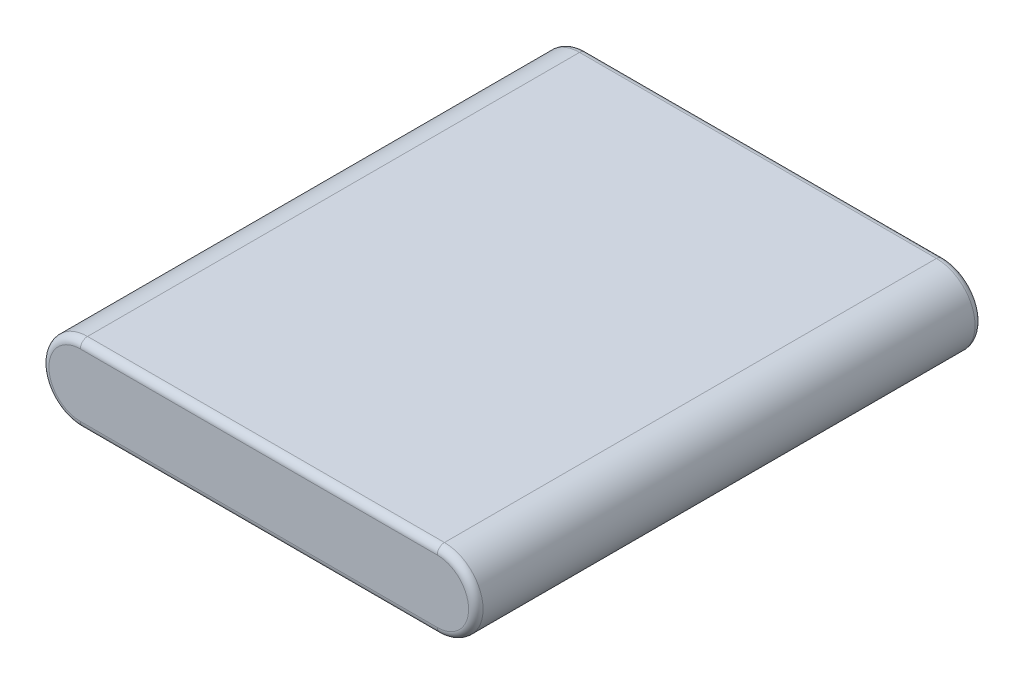
ISO-10303-21;
HEADER;
FILE_DESCRIPTION(('STEP AP214'),'2;1');
FILE_NAME('part.step','',(''),(''),'','','');
FILE_SCHEMA(('AUTOMOTIVE_DESIGN { 1 0 10303 214 1 1 1 1 }'));
ENDSEC;
DATA;
#1=APPLICATION_CONTEXT('core data for automotive mechanical design processes');
#2=APPLICATION_PROTOCOL_DEFINITION('international standard','automotive_design',2000,#1);
#3=PRODUCT_CONTEXT('',#1,'mechanical');
#4=PRODUCT('Part','Part','',(#3));
#5=PRODUCT_RELATED_PRODUCT_CATEGORY('part','',(#4));
#6=PRODUCT_DEFINITION_FORMATION('','',#4);
#7=PRODUCT_DEFINITION_CONTEXT('part definition',#1,'design');
#8=PRODUCT_DEFINITION('design','',#6,#7);
#9=PRODUCT_DEFINITION_SHAPE('','',#8);
#10=(LENGTH_UNIT() NAMED_UNIT(*) SI_UNIT(.MILLI.,.METRE.));
#11=(NAMED_UNIT(*) PLANE_ANGLE_UNIT() SI_UNIT($,.RADIAN.));
#12=(NAMED_UNIT(*) SI_UNIT($,.STERADIAN.) SOLID_ANGLE_UNIT());
#13=UNCERTAINTY_MEASURE_WITH_UNIT(LENGTH_MEASURE(1.E-05),#10,'distance_accuracy_value','');
#14=(GEOMETRIC_REPRESENTATION_CONTEXT(3) GLOBAL_UNCERTAINTY_ASSIGNED_CONTEXT((#13)) GLOBAL_UNIT_ASSIGNED_CONTEXT((#10,
#11,#12)) REPRESENTATION_CONTEXT('',''));
#15=CARTESIAN_POINT('',(0.,0.,0.));
#16=DIRECTION('',(0.,0.,1.));
#17=DIRECTION('',(1.,0.,0.));
#18=AXIS2_PLACEMENT_3D('',#15,#16,#17);
#19=CARTESIAN_POINT('',(37.,0.,52.5));
#20=DIRECTION('',(0.,0.,-1.));
#21=DIRECTION('',(-1.,0.,0.));
#22=AXIS2_PLACEMENT_3D('',#19,#20,#21);
#23=CYLINDRICAL_SURFACE('',#22,7.99999999999999);
#24=DIRECTION('',(0.,0.,-1.));
#25=VECTOR('',#24,1.);
#26=CARTESIAN_POINT('',(37.,-7.99999999999998,52.5));
#27=LINE('',#26,#25);
#28=CARTESIAN_POINT('',(37.,-7.99999999999998,51.));
#29=VERTEX_POINT('',#28);
#30=CARTESIAN_POINT('',(37.,-7.99999999999998,-51.));
#31=VERTEX_POINT('',#30);
#32=EDGE_CURVE('E141',#29,#31,#27,.T.);
#33=ORIENTED_EDGE('',*,*,#32,.T.);
#34=CARTESIAN_POINT('',(37.,0.,-51.));
#35=DIRECTION('',(0.,0.,1.));
#36=DIRECTION('',(1.,0.,0.));
#37=AXIS2_PLACEMENT_3D('',#34,#35,#36);
#38=CIRCLE('',#37,7.99999999999999);
#39=CARTESIAN_POINT('',(37.,8.00000000000001,-51.));
#40=VERTEX_POINT('',#39);
#41=EDGE_CURVE('E150',#31,#40,#38,.T.);
#42=ORIENTED_EDGE('',*,*,#41,.T.);
#43=DIRECTION('',(0.,0.,-1.));
#44=VECTOR('',#43,1.);
#45=CARTESIAN_POINT('',(37.,8.00000000000001,52.5));
#46=LINE('',#45,#44);
#47=CARTESIAN_POINT('',(37.,8.00000000000001,51.));
#48=VERTEX_POINT('',#47);
#49=EDGE_CURVE('E119',#48,#40,#46,.T.);
#50=ORIENTED_EDGE('',*,*,#49,.F.);
#51=CARTESIAN_POINT('',(37.,0.,51.));
#52=DIRECTION('',(0.,0.,1.));
#53=DIRECTION('',(1.,0.,0.));
#54=AXIS2_PLACEMENT_3D('',#51,#52,#53);
#55=CIRCLE('',#54,7.99999999999999);
#56=EDGE_CURVE('E152',#48,#29,#55,.F.);
#57=ORIENTED_EDGE('',*,*,#56,.T.);
#58=EDGE_LOOP('',(#33,#42,#50,#57));
#59=FACE_BOUND('',#58,.T.);
#60=ADVANCED_FACE('F32',(#59),#23,.T.);
#61=CARTESIAN_POINT('',(37.,8.00000000000001,52.5));
#62=DIRECTION('',(0.,-1.,0.));
#63=DIRECTION('',(1.,0.,0.));
#64=AXIS2_PLACEMENT_3D('',#61,#62,#63);
#65=PLANE('',#64);
#66=ORIENTED_EDGE('',*,*,#49,.T.);
#67=DIRECTION('',(-1.,0.,0.));
#68=VECTOR('',#67,1.);
#69=CARTESIAN_POINT('',(37.,8.00000000000001,-51.));
#70=LINE('',#69,#68);
#71=CARTESIAN_POINT('',(-37.,8.00000000000001,-51.));
#72=VERTEX_POINT('',#71);
#73=EDGE_CURVE('E118',#40,#72,#70,.T.);
#74=ORIENTED_EDGE('',*,*,#73,.T.);
#75=DIRECTION('',(0.,0.,-1.));
#76=VECTOR('',#75,1.);
#77=CARTESIAN_POINT('',(-37.,8.00000000000001,52.5));
#78=LINE('',#77,#76);
#79=CARTESIAN_POINT('',(-37.,8.00000000000001,51.));
#80=VERTEX_POINT('',#79);
#81=EDGE_CURVE('E101',#80,#72,#78,.T.);
#82=ORIENTED_EDGE('',*,*,#81,.F.);
#83=DIRECTION('',(-1.,0.,0.));
#84=VECTOR('',#83,1.);
#85=CARTESIAN_POINT('',(37.,8.00000000000001,51.));
#86=LINE('',#85,#84);
#87=EDGE_CURVE('E115',#80,#48,#86,.F.);
#88=ORIENTED_EDGE('',*,*,#87,.T.);
#89=EDGE_LOOP('',(#66,#74,#82,#88));
#90=FACE_BOUND('',#89,.T.);
#91=ADVANCED_FACE('F114',(#90),#65,.F.);
#92=CARTESIAN_POINT('',(-37.,0.,52.5));
#93=DIRECTION('',(0.,0.,-1.));
#94=DIRECTION('',(-1.,0.,0.));
#95=AXIS2_PLACEMENT_3D('',#92,#93,#94);
#96=CYLINDRICAL_SURFACE('',#95,8.);
#97=ORIENTED_EDGE('',*,*,#81,.T.);
#98=CARTESIAN_POINT('',(-37.,0.,-51.));
#99=DIRECTION('',(0.,0.,1.));
#100=DIRECTION('',(1.,0.,0.));
#101=AXIS2_PLACEMENT_3D('',#98,#99,#100);
#102=CIRCLE('',#101,8.);
#103=CARTESIAN_POINT('',(-37.,-7.99999999999999,-51.));
#104=VERTEX_POINT('',#103);
#105=EDGE_CURVE('E107',#72,#104,#102,.T.);
#106=ORIENTED_EDGE('',*,*,#105,.T.);
#107=DIRECTION('',(0.,0.,-1.));
#108=VECTOR('',#107,1.);
#109=CARTESIAN_POINT('',(-37.,-7.99999999999999,52.5));
#110=LINE('',#109,#108);
#111=CARTESIAN_POINT('',(-37.,-7.99999999999999,51.));
#112=VERTEX_POINT('',#111);
#113=EDGE_CURVE('E103',#112,#104,#110,.T.);
#114=ORIENTED_EDGE('',*,*,#113,.F.);
#115=CARTESIAN_POINT('',(-37.,0.,51.));
#116=DIRECTION('',(0.,0.,1.));
#117=DIRECTION('',(1.,0.,0.));
#118=AXIS2_PLACEMENT_3D('',#115,#116,#117);
#119=CIRCLE('',#118,8.);
#120=EDGE_CURVE('E98',#112,#80,#119,.F.);
#121=ORIENTED_EDGE('',*,*,#120,.T.);
#122=EDGE_LOOP('',(#97,#106,#114,#121));
#123=FACE_BOUND('',#122,.T.);
#124=ADVANCED_FACE('F100',(#123),#96,.T.);
#125=CARTESIAN_POINT('',(37.,-7.99999999999998,52.5));
#126=DIRECTION('',(0.,1.,0.));
#127=DIRECTION('',(-1.,0.,0.));
#128=AXIS2_PLACEMENT_3D('',#125,#126,#127);
#129=PLANE('',#128);
#130=ORIENTED_EDGE('',*,*,#113,.T.);
#131=DIRECTION('',(1.,0.,0.));
#132=VECTOR('',#131,1.);
#133=CARTESIAN_POINT('',(37.,-7.99999999999998,-51.));
#134=LINE('',#133,#132);
#135=EDGE_CURVE('E154',#104,#31,#134,.T.);
#136=ORIENTED_EDGE('',*,*,#135,.T.);
#137=ORIENTED_EDGE('',*,*,#32,.F.);
#138=DIRECTION('',(1.,0.,0.));
#139=VECTOR('',#138,1.);
#140=CARTESIAN_POINT('',(-37.,-7.99999999999999,51.));
#141=LINE('',#140,#139);
#142=EDGE_CURVE('E156',#29,#112,#141,.F.);
#143=ORIENTED_EDGE('',*,*,#142,.T.);
#144=EDGE_LOOP('',(#130,#136,#137,#143));
#145=FACE_BOUND('',#144,.T.);
#146=ADVANCED_FACE('F194',(#145),#129,.F.);
#147=CARTESIAN_POINT('',(37.,0.,52.5));
#148=DIRECTION('',(0.,0.,1.));
#149=DIRECTION('',(1.,0.,0.));
#150=AXIS2_PLACEMENT_3D('',#147,#148,#149);
#151=PLANE('',#150);
#152=CARTESIAN_POINT('',(-37.,0.,52.5));
#153=DIRECTION('',(0.,0.,1.));
#154=DIRECTION('',(1.,0.,0.));
#155=AXIS2_PLACEMENT_3D('',#152,#153,#154);
#156=CIRCLE('',#155,6.5);
#157=CARTESIAN_POINT('',(-37.,6.50000000000001,52.5));
#158=VERTEX_POINT('',#157);
#159=CARTESIAN_POINT('',(-37.,-6.49999999999999,52.5));
#160=VERTEX_POINT('',#159);
#161=EDGE_CURVE('E41',#158,#160,#156,.T.);
#162=ORIENTED_EDGE('',*,*,#161,.T.);
#163=DIRECTION('',(1.,0.,0.));
#164=VECTOR('',#163,1.);
#165=CARTESIAN_POINT('',(37.,-6.49999999999998,52.5));
#166=LINE('',#165,#164);
#167=CARTESIAN_POINT('',(37.,-6.49999999999998,52.5));
#168=VERTEX_POINT('',#167);
#169=EDGE_CURVE('E11',#160,#168,#166,.T.);
#170=ORIENTED_EDGE('',*,*,#169,.T.);
#171=CARTESIAN_POINT('',(37.,0.,52.5));
#172=DIRECTION('',(0.,0.,1.));
#173=DIRECTION('',(1.,0.,0.));
#174=AXIS2_PLACEMENT_3D('',#171,#172,#173);
#175=CIRCLE('',#174,6.5);
#176=CARTESIAN_POINT('',(37.,6.50000000000001,52.5));
#177=VERTEX_POINT('',#176);
#178=EDGE_CURVE('E148',#168,#177,#175,.T.);
#179=ORIENTED_EDGE('',*,*,#178,.T.);
#180=DIRECTION('',(-1.,0.,0.));
#181=VECTOR('',#180,1.);
#182=CARTESIAN_POINT('',(-37.,6.50000000000001,52.5));
#183=LINE('',#182,#181);
#184=EDGE_CURVE('E52',#177,#158,#183,.T.);
#185=ORIENTED_EDGE('',*,*,#184,.T.);
#186=EDGE_LOOP('',(#162,#170,#179,#185));
#187=FACE_BOUND('',#186,.T.);
#188=ADVANCED_FACE('F200',(#187),#151,.T.);
#189=CARTESIAN_POINT('',(37.,0.,-52.5));
#190=DIRECTION('',(0.,0.,1.));
#191=DIRECTION('',(1.,0.,0.));
#192=AXIS2_PLACEMENT_3D('',#189,#190,#191);
#193=PLANE('',#192);
#194=CARTESIAN_POINT('',(-37.,0.,-52.5));
#195=DIRECTION('',(0.,0.,1.));
#196=DIRECTION('',(1.,0.,0.));
#197=AXIS2_PLACEMENT_3D('',#194,#195,#196);
#198=CIRCLE('',#197,6.5);
#199=CARTESIAN_POINT('',(-37.,-6.49999999999999,-52.5));
#200=VERTEX_POINT('',#199);
#201=CARTESIAN_POINT('',(-37.,6.50000000000001,-52.5));
#202=VERTEX_POINT('',#201);
#203=EDGE_CURVE('E161',#200,#202,#198,.F.);
#204=ORIENTED_EDGE('',*,*,#203,.T.);
#205=DIRECTION('',(-1.,0.,0.));
#206=VECTOR('',#205,1.);
#207=CARTESIAN_POINT('',(37.,6.50000000000001,-52.5));
#208=LINE('',#207,#206);
#209=CARTESIAN_POINT('',(37.,6.50000000000001,-52.5));
#210=VERTEX_POINT('',#209);
#211=EDGE_CURVE('E108',#202,#210,#208,.F.);
#212=ORIENTED_EDGE('',*,*,#211,.T.);
#213=CARTESIAN_POINT('',(37.,0.,-52.5));
#214=DIRECTION('',(0.,0.,1.));
#215=DIRECTION('',(1.,0.,0.));
#216=AXIS2_PLACEMENT_3D('',#213,#214,#215);
#217=CIRCLE('',#216,6.5);
#218=CARTESIAN_POINT('',(37.,-6.49999999999998,-52.5));
#219=VERTEX_POINT('',#218);
#220=EDGE_CURVE('E165',#210,#219,#217,.F.);
#221=ORIENTED_EDGE('',*,*,#220,.T.);
#222=DIRECTION('',(1.,0.,0.));
#223=VECTOR('',#222,1.);
#224=CARTESIAN_POINT('',(37.,-6.49999999999998,-52.5));
#225=LINE('',#224,#223);
#226=EDGE_CURVE('E163',#219,#200,#225,.F.);
#227=ORIENTED_EDGE('',*,*,#226,.T.);
#228=EDGE_LOOP('',(#204,#212,#221,#227));
#229=FACE_BOUND('',#228,.T.);
#230=ADVANCED_FACE('F202',(#229),#193,.F.);
#231=CARTESIAN_POINT('',(37.,-6.49999999999998,-51.));
#232=DIRECTION('',(1.,0.,0.));
#233=DIRECTION('',(0.,1.,0.));
#234=AXIS2_PLACEMENT_3D('',#231,#232,#233);
#235=CYLINDRICAL_SURFACE('',#234,1.5);
#236=CARTESIAN_POINT('',(-37.,-6.49999999999999,-51.));
#237=DIRECTION('',(-1.,0.,0.));
#238=DIRECTION('',(0.,0.,1.));
#239=AXIS2_PLACEMENT_3D('',#236,#237,#238);
#240=CIRCLE('',#239,1.5);
#241=EDGE_CURVE('E142',#200,#104,#240,.T.);
#242=ORIENTED_EDGE('',*,*,#241,.F.);
#243=ORIENTED_EDGE('',*,*,#226,.F.);
#244=CARTESIAN_POINT('',(37.,-6.49999999999998,-51.));
#245=DIRECTION('',(1.,0.,0.));
#246=DIRECTION('',(0.,0.,-1.));
#247=AXIS2_PLACEMENT_3D('',#244,#245,#246);
#248=CIRCLE('',#247,1.5);
#249=EDGE_CURVE('E138',#31,#219,#248,.T.);
#250=ORIENTED_EDGE('',*,*,#249,.F.);
#251=ORIENTED_EDGE('',*,*,#135,.F.);
#252=EDGE_LOOP('',(#242,#243,#250,#251));
#253=FACE_BOUND('',#252,.T.);
#254=ADVANCED_FACE('F181',(#253),#235,.T.);
#255=CARTESIAN_POINT('',(37.,0.,-51.));
#256=DIRECTION('',(0.,0.,1.));
#257=DIRECTION('',(1.,0.,0.));
#258=AXIS2_PLACEMENT_3D('',#255,#256,#257);
#259=TOROIDAL_SURFACE('',#258,6.5,1.5);
#260=ORIENTED_EDGE('',*,*,#249,.T.);
#261=ORIENTED_EDGE('',*,*,#220,.F.);
#262=CARTESIAN_POINT('',(37.,6.50000000000001,-51.));
#263=DIRECTION('',(-1.,0.,0.));
#264=DIRECTION('',(0.,0.,1.));
#265=AXIS2_PLACEMENT_3D('',#262,#263,#264);
#266=CIRCLE('',#265,1.5);
#267=EDGE_CURVE('E129',#40,#210,#266,.T.);
#268=ORIENTED_EDGE('',*,*,#267,.F.);
#269=ORIENTED_EDGE('',*,*,#41,.F.);
#270=EDGE_LOOP('',(#260,#261,#268,#269));
#271=FACE_BOUND('',#270,.T.);
#272=ADVANCED_FACE('F185',(#271),#259,.T.);
#273=CARTESIAN_POINT('',(-37.,0.,-51.));
#274=DIRECTION('',(0.,0.,1.));
#275=DIRECTION('',(1.,0.,0.));
#276=AXIS2_PLACEMENT_3D('',#273,#274,#275);
#277=TOROIDAL_SURFACE('',#276,6.5,1.5);
#278=ORIENTED_EDGE('',*,*,#241,.T.);
#279=ORIENTED_EDGE('',*,*,#105,.F.);
#280=CARTESIAN_POINT('',(-37.,6.50000000000001,-51.));
#281=DIRECTION('',(1.,0.,0.));
#282=DIRECTION('',(0.,0.,-1.));
#283=AXIS2_PLACEMENT_3D('',#280,#281,#282);
#284=CIRCLE('',#283,1.5);
#285=EDGE_CURVE('E128',#202,#72,#284,.T.);
#286=ORIENTED_EDGE('',*,*,#285,.F.);
#287=ORIENTED_EDGE('',*,*,#203,.F.);
#288=EDGE_LOOP('',(#278,#279,#286,#287));
#289=FACE_BOUND('',#288,.T.);
#290=ADVANCED_FACE('F193',(#289),#277,.T.);
#291=CARTESIAN_POINT('',(37.,6.50000000000001,-51.));
#292=DIRECTION('',(-1.,0.,0.));
#293=DIRECTION('',(0.,-1.,0.));
#294=AXIS2_PLACEMENT_3D('',#291,#292,#293);
#295=CYLINDRICAL_SURFACE('',#294,1.5);
#296=ORIENTED_EDGE('',*,*,#267,.T.);
#297=ORIENTED_EDGE('',*,*,#211,.F.);
#298=ORIENTED_EDGE('',*,*,#285,.T.);
#299=ORIENTED_EDGE('',*,*,#73,.F.);
#300=EDGE_LOOP('',(#296,#297,#298,#299));
#301=FACE_BOUND('',#300,.T.);
#302=ADVANCED_FACE('F188',(#301),#295,.T.);
#303=CARTESIAN_POINT('',(37.,6.50000000000001,51.));
#304=DIRECTION('',(1.,0.,0.));
#305=DIRECTION('',(0.,1.,0.));
#306=AXIS2_PLACEMENT_3D('',#303,#304,#305);
#307=CYLINDRICAL_SURFACE('',#306,1.5);
#308=CARTESIAN_POINT('',(37.,6.50000000000001,51.));
#309=DIRECTION('',(1.,0.,0.));
#310=DIRECTION('',(0.,0.,-1.));
#311=AXIS2_PLACEMENT_3D('',#308,#309,#310);
#312=CIRCLE('',#311,1.5);
#313=EDGE_CURVE('E124',#48,#177,#312,.T.);
#314=ORIENTED_EDGE('',*,*,#313,.F.);
#315=ORIENTED_EDGE('',*,*,#87,.F.);
#316=CARTESIAN_POINT('',(-37.,6.50000000000001,51.));
#317=DIRECTION('',(-1.,0.,0.));
#318=DIRECTION('',(0.,0.,1.));
#319=AXIS2_PLACEMENT_3D('',#316,#317,#318);
#320=CIRCLE('',#319,1.5);
#321=EDGE_CURVE('E36',#158,#80,#320,.T.);
#322=ORIENTED_EDGE('',*,*,#321,.F.);
#323=ORIENTED_EDGE('',*,*,#184,.F.);
#324=EDGE_LOOP('',(#314,#315,#322,#323));
#325=FACE_BOUND('',#324,.T.);
#326=ADVANCED_FACE('F34',(#325),#307,.T.);
#327=CARTESIAN_POINT('',(-37.,0.,51.));
#328=DIRECTION('',(0.,0.,1.));
#329=DIRECTION('',(1.,0.,0.));
#330=AXIS2_PLACEMENT_3D('',#327,#328,#329);
#331=TOROIDAL_SURFACE('',#330,6.5,1.5);
#332=ORIENTED_EDGE('',*,*,#321,.T.);
#333=ORIENTED_EDGE('',*,*,#120,.F.);
#334=CARTESIAN_POINT('',(-37.,-6.49999999999999,51.));
#335=DIRECTION('',(1.,0.,0.));
#336=DIRECTION('',(0.,0.,-1.));
#337=AXIS2_PLACEMENT_3D('',#334,#335,#336);
#338=CIRCLE('',#337,1.5);
#339=EDGE_CURVE('E131',#160,#112,#338,.T.);
#340=ORIENTED_EDGE('',*,*,#339,.F.);
#341=ORIENTED_EDGE('',*,*,#161,.F.);
#342=EDGE_LOOP('',(#332,#333,#340,#341));
#343=FACE_BOUND('',#342,.T.);
#344=ADVANCED_FACE('F127',(#343),#331,.T.);
#345=CARTESIAN_POINT('',(37.,0.,51.));
#346=DIRECTION('',(0.,0.,1.));
#347=DIRECTION('',(1.,0.,0.));
#348=AXIS2_PLACEMENT_3D('',#345,#346,#347);
#349=TOROIDAL_SURFACE('',#348,6.5,1.5);
#350=ORIENTED_EDGE('',*,*,#313,.T.);
#351=ORIENTED_EDGE('',*,*,#178,.F.);
#352=CARTESIAN_POINT('',(37.,-6.49999999999998,51.));
#353=DIRECTION('',(-1.,0.,0.));
#354=DIRECTION('',(0.,0.,1.));
#355=AXIS2_PLACEMENT_3D('',#352,#353,#354);
#356=CIRCLE('',#355,1.5);
#357=EDGE_CURVE('E134',#29,#168,#356,.T.);
#358=ORIENTED_EDGE('',*,*,#357,.F.);
#359=ORIENTED_EDGE('',*,*,#56,.F.);
#360=EDGE_LOOP('',(#350,#351,#358,#359));
#361=FACE_BOUND('',#360,.T.);
#362=ADVANCED_FACE('F199',(#361),#349,.T.);
#363=CARTESIAN_POINT('',(37.,-6.49999999999998,51.));
#364=DIRECTION('',(-1.,0.,0.));
#365=DIRECTION('',(0.,-1.,0.));
#366=AXIS2_PLACEMENT_3D('',#363,#364,#365);
#367=CYLINDRICAL_SURFACE('',#366,1.5);
#368=ORIENTED_EDGE('',*,*,#339,.T.);
#369=ORIENTED_EDGE('',*,*,#142,.F.);
#370=ORIENTED_EDGE('',*,*,#357,.T.);
#371=ORIENTED_EDGE('',*,*,#169,.F.);
#372=EDGE_LOOP('',(#368,#369,#370,#371));
#373=FACE_BOUND('',#372,.T.);
#374=ADVANCED_FACE('F197',(#373),#367,.T.);
#375=CLOSED_SHELL('',(#60,#91,#124,#146,#188,#230,#254,#272,#290,#302,#326,#344,#362,#374));
#376=MANIFOLD_SOLID_BREP('B2',#375);
#377=ADVANCED_BREP_SHAPE_REPRESENTATION('',(#18,#376),#14);
#378=SHAPE_DEFINITION_REPRESENTATION(#9,#377);
ENDSEC;
END-ISO-10303-21;
